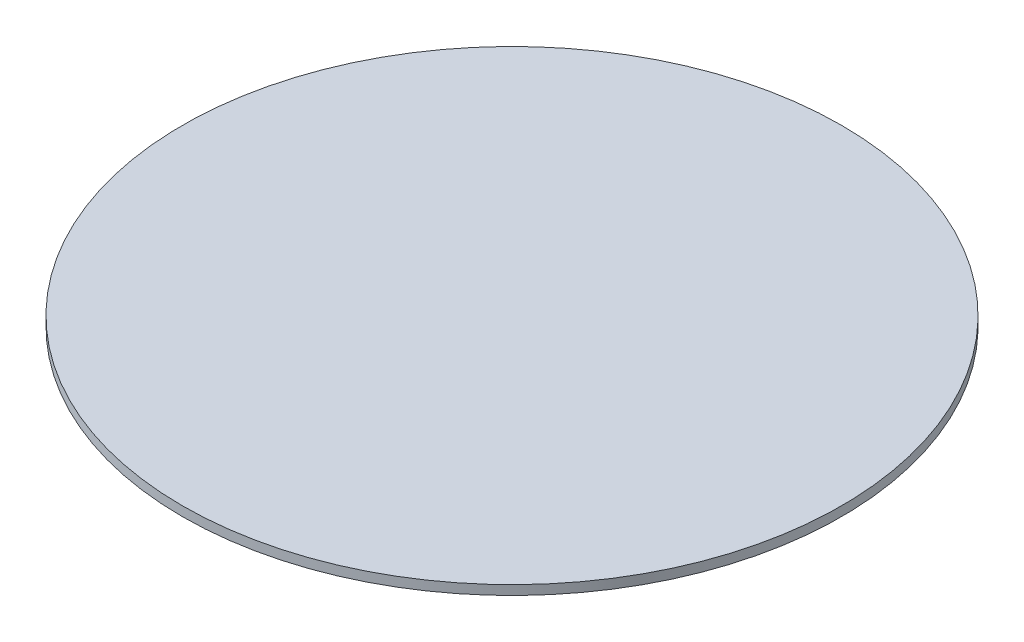
ISO-10303-21;
HEADER;
FILE_DESCRIPTION(('STEP AP214'),'2;1');
FILE_NAME('part.step','',(''),(''),'','','');
FILE_SCHEMA(('AUTOMOTIVE_DESIGN { 1 0 10303 214 1 1 1 1 }'));
ENDSEC;
DATA;
#1=APPLICATION_CONTEXT('core data for automotive mechanical design processes');
#2=APPLICATION_PROTOCOL_DEFINITION('international standard','automotive_design',2000,#1);
#3=PRODUCT_CONTEXT('',#1,'mechanical');
#4=PRODUCT('Part','Part','',(#3));
#5=PRODUCT_RELATED_PRODUCT_CATEGORY('part','',(#4));
#6=PRODUCT_DEFINITION_FORMATION('','',#4);
#7=PRODUCT_DEFINITION_CONTEXT('part definition',#1,'design');
#8=PRODUCT_DEFINITION('design','',#6,#7);
#9=PRODUCT_DEFINITION_SHAPE('','',#8);
#10=(LENGTH_UNIT() NAMED_UNIT(*) SI_UNIT(.MILLI.,.METRE.));
#11=(NAMED_UNIT(*) PLANE_ANGLE_UNIT() SI_UNIT($,.RADIAN.));
#12=(NAMED_UNIT(*) SI_UNIT($,.STERADIAN.) SOLID_ANGLE_UNIT());
#13=UNCERTAINTY_MEASURE_WITH_UNIT(LENGTH_MEASURE(1.E-05),#10,'distance_accuracy_value','');
#14=(GEOMETRIC_REPRESENTATION_CONTEXT(3) GLOBAL_UNCERTAINTY_ASSIGNED_CONTEXT((#13)) GLOBAL_UNIT_ASSIGNED_CONTEXT((#10,
#11,#12)) REPRESENTATION_CONTEXT('',''));
#15=CARTESIAN_POINT('',(0.,0.,0.));
#16=DIRECTION('',(0.,0.,1.));
#17=DIRECTION('',(1.,0.,0.));
#18=AXIS2_PLACEMENT_3D('',#15,#16,#17);
#19=CARTESIAN_POINT('',(0.,0.3,0.));
#20=DIRECTION('',(0.,-1.,0.));
#21=DIRECTION('',(0.,0.,-1.));
#22=AXIS2_PLACEMENT_3D('',#19,#20,#21);
#23=CYLINDRICAL_SURFACE('',#22,10.5);
#24=CARTESIAN_POINT('',(0.,0.3,0.));
#25=DIRECTION('',(0.,1.,0.));
#26=DIRECTION('',(0.,0.,1.));
#27=AXIS2_PLACEMENT_3D('',#24,#25,#26);
#28=CIRCLE('',#27,10.5);
#29=CARTESIAN_POINT('',(0.,0.3,10.5));
#30=VERTEX_POINT('',#29);
#31=EDGE_CURVE('E10',#30,#30,#28,.T.);
#32=ORIENTED_EDGE('',*,*,#31,.F.);
#33=EDGE_LOOP('',(#32));
#34=FACE_BOUND('',#33,.T.);
#35=CARTESIAN_POINT('',(0.,0.,0.));
#36=DIRECTION('',(0.,1.,0.));
#37=DIRECTION('',(0.,0.,1.));
#38=AXIS2_PLACEMENT_3D('',#35,#36,#37);
#39=CIRCLE('',#38,10.5);
#40=CARTESIAN_POINT('',(0.,0.,10.5));
#41=VERTEX_POINT('',#40);
#42=EDGE_CURVE('E38',#41,#41,#39,.T.);
#43=ORIENTED_EDGE('',*,*,#42,.T.);
#44=EDGE_LOOP('',(#43));
#45=FACE_BOUND('',#44,.T.);
#46=ADVANCED_FACE('F35',(#34,#45),#23,.T.);
#47=CARTESIAN_POINT('',(0.,0.3,0.));
#48=DIRECTION('',(0.,1.,0.));
#49=DIRECTION('',(0.,0.,1.));
#50=AXIS2_PLACEMENT_3D('',#47,#48,#49);
#51=PLANE('',#50);
#52=ORIENTED_EDGE('',*,*,#31,.T.);
#53=EDGE_LOOP('',(#52));
#54=FACE_BOUND('',#53,.T.);
#55=ADVANCED_FACE('F50',(#54),#51,.T.);
#56=CARTESIAN_POINT('',(0.,0.,0.));
#57=DIRECTION('',(0.,1.,0.));
#58=DIRECTION('',(0.,0.,1.));
#59=AXIS2_PLACEMENT_3D('',#56,#57,#58);
#60=PLANE('',#59);
#61=ORIENTED_EDGE('',*,*,#42,.F.);
#62=EDGE_LOOP('',(#61));
#63=FACE_BOUND('',#62,.T.);
#64=ADVANCED_FACE('F48',(#63),#60,.F.);
#65=CLOSED_SHELL('',(#46,#55,#64));
#66=MANIFOLD_SOLID_BREP('B2',#65);
#67=ADVANCED_BREP_SHAPE_REPRESENTATION('',(#18,#66),#14);
#68=SHAPE_DEFINITION_REPRESENTATION(#9,#67);
ENDSEC;
END-ISO-10303-21;
